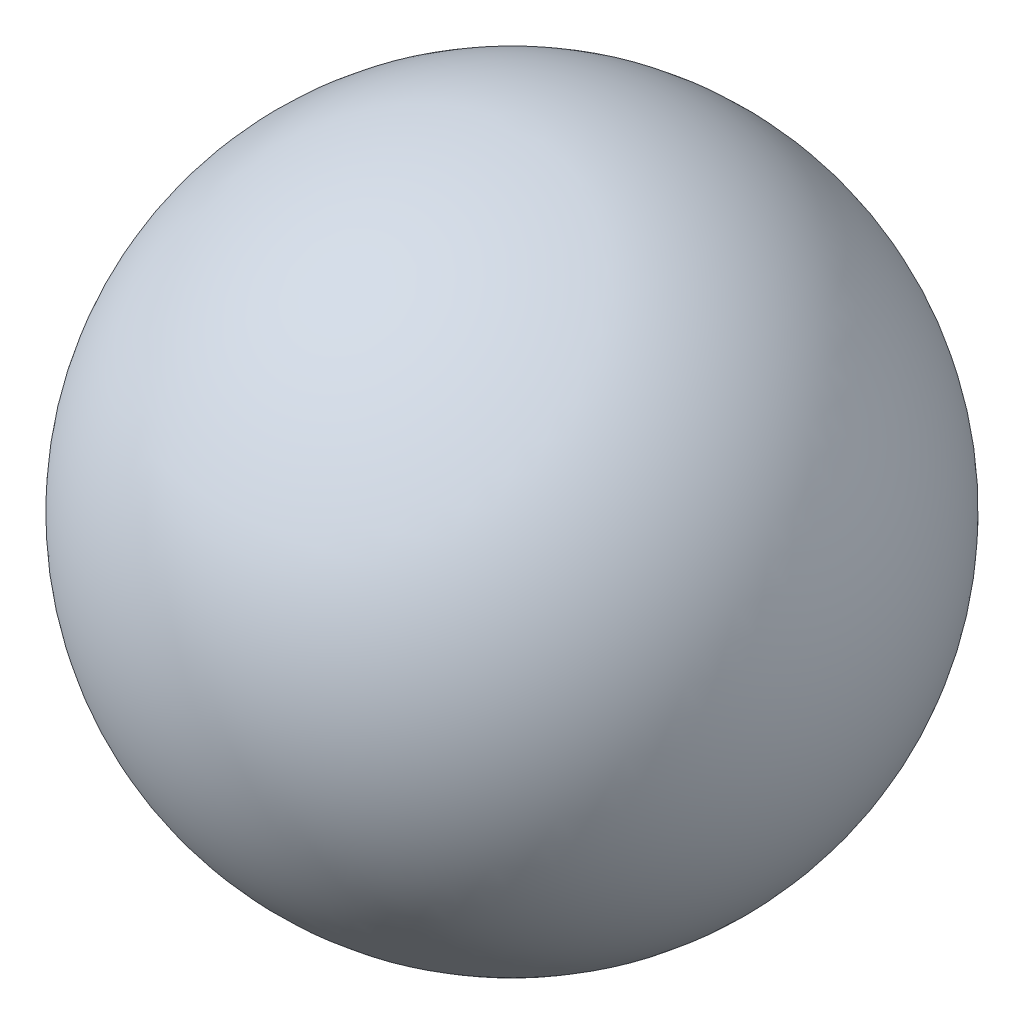
ISO-10303-21;
HEADER;
FILE_DESCRIPTION(('STEP AP214'),'2;1');
FILE_NAME('part.step','',(''),(''),'','','');
FILE_SCHEMA(('AUTOMOTIVE_DESIGN { 1 0 10303 214 1 1 1 1 }'));
ENDSEC;
DATA;
#1=APPLICATION_CONTEXT('core data for automotive mechanical design processes');
#2=APPLICATION_PROTOCOL_DEFINITION('international standard','automotive_design',2000,#1);
#3=PRODUCT_CONTEXT('',#1,'mechanical');
#4=PRODUCT('Part','Part','',(#3));
#5=PRODUCT_RELATED_PRODUCT_CATEGORY('part','',(#4));
#6=PRODUCT_DEFINITION_FORMATION('','',#4);
#7=PRODUCT_DEFINITION_CONTEXT('part definition',#1,'design');
#8=PRODUCT_DEFINITION('design','',#6,#7);
#9=PRODUCT_DEFINITION_SHAPE('','',#8);
#10=(LENGTH_UNIT() NAMED_UNIT(*) SI_UNIT(.MILLI.,.METRE.));
#11=(NAMED_UNIT(*) PLANE_ANGLE_UNIT() SI_UNIT($,.RADIAN.));
#12=(NAMED_UNIT(*) SI_UNIT($,.STERADIAN.) SOLID_ANGLE_UNIT());
#13=UNCERTAINTY_MEASURE_WITH_UNIT(LENGTH_MEASURE(1.E-05),#10,'distance_accuracy_value','');
#14=(GEOMETRIC_REPRESENTATION_CONTEXT(3) GLOBAL_UNCERTAINTY_ASSIGNED_CONTEXT((#13)) GLOBAL_UNIT_ASSIGNED_CONTEXT((#10,
#11,#12)) REPRESENTATION_CONTEXT('',''));
#15=CARTESIAN_POINT('',(0.,0.,0.));
#16=DIRECTION('',(0.,0.,1.));
#17=DIRECTION('',(1.,0.,0.));
#18=AXIS2_PLACEMENT_3D('',#15,#16,#17);
#19=CARTESIAN_POINT('',(0.,0.,0.));
#20=DIRECTION('',(0.,1.,0.));
#21=DIRECTION('',(1.,0.,0.));
#22=AXIS2_PLACEMENT_3D('',#19,#20,#21);
#23=SPHERICAL_SURFACE('',#22,1.5875);
#24=CARTESIAN_POINT('',(0.,-1.37983017876114,0.));
#25=DIRECTION('',(0.,1.,0.));
#26=DIRECTION('',(0.,0.,1.));
#27=AXIS2_PLACEMENT_3D('',#24,#25,#26);
#28=CIRCLE('',#27,0.784999954);
#29=CARTESIAN_POINT('',(0.,-1.37983017876114,0.784999954));
#30=VERTEX_POINT('',#29);
#31=EDGE_CURVE('E11',#30,#30,#28,.T.);
#32=ORIENTED_EDGE('',*,*,#31,.T.);
#33=EDGE_LOOP('',(#32));
#34=FACE_BOUND('',#33,.T.);
#35=ADVANCED_FACE('F36',(#34),#23,.T.);
#36=CARTESIAN_POINT('',(0.,-1.5875,0.));
#37=DIRECTION('',(0.,-1.,0.));
#38=DIRECTION('',(0.,0.,-1.));
#39=AXIS2_PLACEMENT_3D('',#36,#37,#38);
#40=CYLINDRICAL_SURFACE('',#39,0.784999954);
#41=CARTESIAN_POINT('',(0.,0.00250000000000011,0.));
#42=DIRECTION('',(0.,-1.,0.));
#43=DIRECTION('',(0.,0.,-1.));
#44=AXIS2_PLACEMENT_3D('',#41,#42,#43);
#45=CIRCLE('',#44,0.784999954);
#46=CARTESIAN_POINT('',(0.,0.00250000000000011,-0.784999954));
#47=VERTEX_POINT('',#46);
#48=EDGE_CURVE('E42',#47,#47,#45,.T.);
#49=ORIENTED_EDGE('',*,*,#48,.F.);
#50=EDGE_LOOP('',(#49));
#51=FACE_BOUND('',#50,.T.);
#52=ORIENTED_EDGE('',*,*,#31,.F.);
#53=EDGE_LOOP('',(#52));
#54=FACE_BOUND('',#53,.T.);
#55=ADVANCED_FACE('F48',(#51,#54),#40,.F.);
#56=CARTESIAN_POINT('',(0.,0.00250000000000011,0.));
#57=DIRECTION('',(0.,-1.,0.));
#58=DIRECTION('',(0.,0.,-1.));
#59=AXIS2_PLACEMENT_3D('',#56,#57,#58);
#60=CONICAL_SURFACE('',#59,0.784999954,1.02974425867665);
#61=CARTESIAN_POINT('',(0.,0.474175558297046,0.));
#62=VERTEX_POINT('',#61);
#63=VERTEX_LOOP('',#62);
#64=FACE_BOUND('',#63,.T.);
#65=ORIENTED_EDGE('',*,*,#48,.T.);
#66=EDGE_LOOP('',(#65));
#67=FACE_BOUND('',#66,.T.);
#68=ADVANCED_FACE('F45',(#64,#67),#60,.F.);
#69=CLOSED_SHELL('',(#35,#55,#68));
#70=MANIFOLD_SOLID_BREP('B2',#69);
#71=ADVANCED_BREP_SHAPE_REPRESENTATION('',(#18,#70),#14);
#72=SHAPE_DEFINITION_REPRESENTATION(#9,#71);
ENDSEC;
END-ISO-10303-21;
